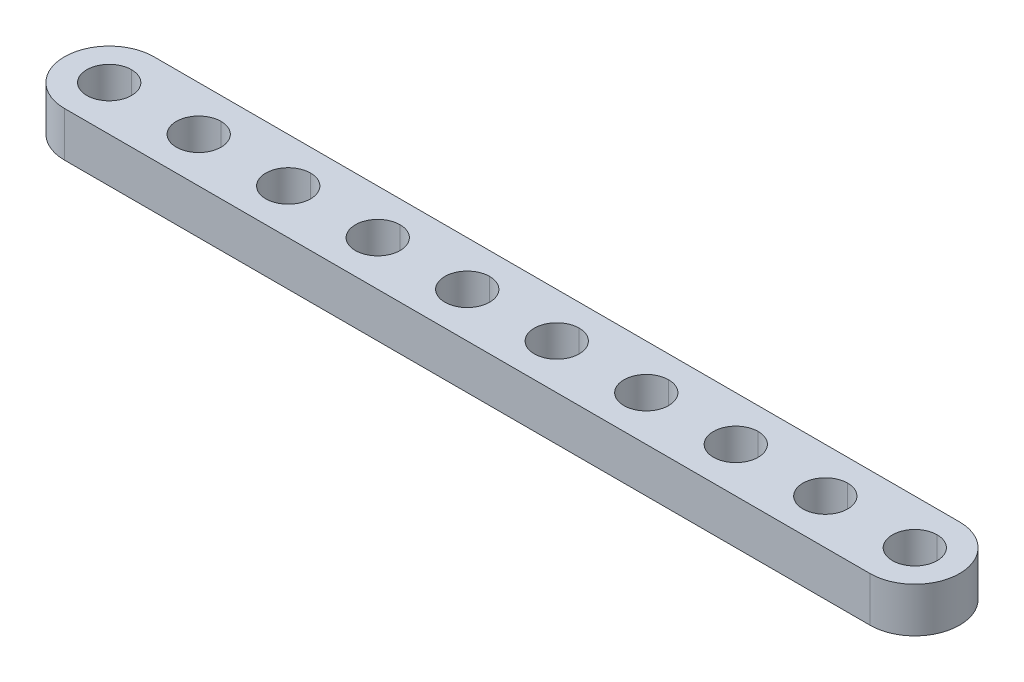
ISO-10303-21;
HEADER;
FILE_DESCRIPTION(('STEP AP214'),'2;1');
FILE_NAME('part.step','',(''),(''),'','','');
FILE_SCHEMA(('AUTOMOTIVE_DESIGN { 1 0 10303 214 1 1 1 1 }'));
ENDSEC;
DATA;
#1=APPLICATION_CONTEXT('core data for automotive mechanical design processes');
#2=APPLICATION_PROTOCOL_DEFINITION('international standard','automotive_design',2000,#1);
#3=PRODUCT_CONTEXT('',#1,'mechanical');
#4=PRODUCT('Part','Part','',(#3));
#5=PRODUCT_RELATED_PRODUCT_CATEGORY('part','',(#4));
#6=PRODUCT_DEFINITION_FORMATION('','',#4);
#7=PRODUCT_DEFINITION_CONTEXT('part definition',#1,'design');
#8=PRODUCT_DEFINITION('design','',#6,#7);
#9=PRODUCT_DEFINITION_SHAPE('','',#8);
#10=(LENGTH_UNIT() NAMED_UNIT(*) SI_UNIT(.MILLI.,.METRE.));
#11=(NAMED_UNIT(*) PLANE_ANGLE_UNIT() SI_UNIT($,.RADIAN.));
#12=(NAMED_UNIT(*) SI_UNIT($,.STERADIAN.) SOLID_ANGLE_UNIT());
#13=UNCERTAINTY_MEASURE_WITH_UNIT(LENGTH_MEASURE(1.E-05),#10,'distance_accuracy_value','');
#14=(GEOMETRIC_REPRESENTATION_CONTEXT(3) GLOBAL_UNCERTAINTY_ASSIGNED_CONTEXT((#13)) GLOBAL_UNIT_ASSIGNED_CONTEXT((#10,
#11,#12)) REPRESENTATION_CONTEXT('',''));
#15=CARTESIAN_POINT('',(0.,0.,0.));
#16=DIRECTION('',(0.,0.,1.));
#17=DIRECTION('',(1.,0.,0.));
#18=AXIS2_PLACEMENT_3D('',#15,#16,#17);
#19=CARTESIAN_POINT('',(36.,4.,0.));
#20=DIRECTION('',(0.,1.,0.));
#21=DIRECTION('',(0.,0.,1.));
#22=AXIS2_PLACEMENT_3D('',#19,#20,#21);
#23=CYLINDRICAL_SURFACE('',#22,2.);
#24=DIRECTION('',(0.,1.,0.));
#25=VECTOR('',#24,1.);
#26=CARTESIAN_POINT('',(36.,4.,-2.));
#27=LINE('',#26,#25);
#28=CARTESIAN_POINT('',(36.,0.,-2.));
#29=VERTEX_POINT('',#28);
#30=CARTESIAN_POINT('',(36.,4.,-2.));
#31=VERTEX_POINT('',#30);
#32=EDGE_CURVE('E283',#29,#31,#27,.T.);
#33=ORIENTED_EDGE('',*,*,#32,.F.);
#34=CARTESIAN_POINT('',(36.,0.,0.));
#35=DIRECTION('',(0.,1.,0.));
#36=DIRECTION('',(0.,0.,1.));
#37=AXIS2_PLACEMENT_3D('',#34,#35,#36);
#38=CIRCLE('',#37,2.);
#39=CARTESIAN_POINT('',(36.,0.,2.));
#40=VERTEX_POINT('',#39);
#41=EDGE_CURVE('E241',#40,#29,#38,.T.);
#42=ORIENTED_EDGE('',*,*,#41,.F.);
#43=DIRECTION('',(0.,1.,0.));
#44=VECTOR('',#43,1.);
#45=CARTESIAN_POINT('',(36.,4.,2.));
#46=LINE('',#45,#44);
#47=CARTESIAN_POINT('',(36.,4.,2.));
#48=VERTEX_POINT('',#47);
#49=EDGE_CURVE('E282',#40,#48,#46,.T.);
#50=ORIENTED_EDGE('',*,*,#49,.T.);
#51=CARTESIAN_POINT('',(36.,4.,0.));
#52=DIRECTION('',(0.,1.,0.));
#53=DIRECTION('',(0.,0.,1.));
#54=AXIS2_PLACEMENT_3D('',#51,#52,#53);
#55=CIRCLE('',#54,2.);
#56=EDGE_CURVE('E356',#48,#31,#55,.T.);
#57=ORIENTED_EDGE('',*,*,#56,.T.);
#58=EDGE_LOOP('',(#33,#42,#50,#57));
#59=FACE_BOUND('',#58,.T.);
#60=ADVANCED_FACE('F14',(#59),#23,.F.);
#61=CARTESIAN_POINT('',(28.,4.,0.));
#62=DIRECTION('',(0.,1.,0.));
#63=DIRECTION('',(0.,0.,1.));
#64=AXIS2_PLACEMENT_3D('',#61,#62,#63);
#65=CYLINDRICAL_SURFACE('',#64,2.);
#66=DIRECTION('',(0.,1.,0.));
#67=VECTOR('',#66,1.);
#68=CARTESIAN_POINT('',(28.,4.,-2.));
#69=LINE('',#68,#67);
#70=CARTESIAN_POINT('',(28.,0.,-2.));
#71=VERTEX_POINT('',#70);
#72=CARTESIAN_POINT('',(28.,4.,-2.));
#73=VERTEX_POINT('',#72);
#74=EDGE_CURVE('E322',#71,#73,#69,.T.);
#75=ORIENTED_EDGE('',*,*,#74,.F.);
#76=CARTESIAN_POINT('',(28.,0.,0.));
#77=DIRECTION('',(0.,1.,0.));
#78=DIRECTION('',(0.,0.,1.));
#79=AXIS2_PLACEMENT_3D('',#76,#77,#78);
#80=CIRCLE('',#79,2.);
#81=CARTESIAN_POINT('',(28.,0.,2.));
#82=VERTEX_POINT('',#81);
#83=EDGE_CURVE('E330',#82,#71,#80,.T.);
#84=ORIENTED_EDGE('',*,*,#83,.F.);
#85=DIRECTION('',(0.,1.,0.));
#86=VECTOR('',#85,1.);
#87=CARTESIAN_POINT('',(28.,4.,2.));
#88=LINE('',#87,#86);
#89=CARTESIAN_POINT('',(28.,4.,2.));
#90=VERTEX_POINT('',#89);
#91=EDGE_CURVE('E284',#82,#90,#88,.T.);
#92=ORIENTED_EDGE('',*,*,#91,.T.);
#93=CARTESIAN_POINT('',(28.,4.,0.));
#94=DIRECTION('',(0.,1.,0.));
#95=DIRECTION('',(0.,0.,1.));
#96=AXIS2_PLACEMENT_3D('',#93,#94,#95);
#97=CIRCLE('',#96,2.);
#98=EDGE_CURVE('E302',#90,#73,#97,.T.);
#99=ORIENTED_EDGE('',*,*,#98,.T.);
#100=EDGE_LOOP('',(#75,#84,#92,#99));
#101=FACE_BOUND('',#100,.T.);
#102=ADVANCED_FACE('F587',(#101),#65,.F.);
#103=CARTESIAN_POINT('',(20.,4.,0.));
#104=DIRECTION('',(0.,1.,0.));
#105=DIRECTION('',(0.,0.,1.));
#106=AXIS2_PLACEMENT_3D('',#103,#104,#105);
#107=CYLINDRICAL_SURFACE('',#106,2.);
#108=DIRECTION('',(0.,1.,0.));
#109=VECTOR('',#108,1.);
#110=CARTESIAN_POINT('',(20.,4.,-2.));
#111=LINE('',#110,#109);
#112=CARTESIAN_POINT('',(20.,0.,-2.));
#113=VERTEX_POINT('',#112);
#114=CARTESIAN_POINT('',(20.,4.,-2.));
#115=VERTEX_POINT('',#114);
#116=EDGE_CURVE('E323',#113,#115,#111,.T.);
#117=ORIENTED_EDGE('',*,*,#116,.F.);
#118=CARTESIAN_POINT('',(20.,0.,0.));
#119=DIRECTION('',(0.,1.,0.));
#120=DIRECTION('',(0.,0.,1.));
#121=AXIS2_PLACEMENT_3D('',#118,#119,#120);
#122=CIRCLE('',#121,2.);
#123=CARTESIAN_POINT('',(20.,0.,2.));
#124=VERTEX_POINT('',#123);
#125=EDGE_CURVE('E298',#124,#113,#122,.T.);
#126=ORIENTED_EDGE('',*,*,#125,.F.);
#127=DIRECTION('',(0.,1.,0.));
#128=VECTOR('',#127,1.);
#129=CARTESIAN_POINT('',(20.,4.,2.));
#130=LINE('',#129,#128);
#131=CARTESIAN_POINT('',(20.,4.,2.));
#132=VERTEX_POINT('',#131);
#133=EDGE_CURVE('E334',#124,#132,#130,.T.);
#134=ORIENTED_EDGE('',*,*,#133,.T.);
#135=CARTESIAN_POINT('',(20.,4.,0.));
#136=DIRECTION('',(0.,1.,0.));
#137=DIRECTION('',(0.,0.,1.));
#138=AXIS2_PLACEMENT_3D('',#135,#136,#137);
#139=CIRCLE('',#138,2.);
#140=EDGE_CURVE('E156',#132,#115,#139,.T.);
#141=ORIENTED_EDGE('',*,*,#140,.T.);
#142=EDGE_LOOP('',(#117,#126,#134,#141));
#143=FACE_BOUND('',#142,.T.);
#144=ADVANCED_FACE('F593',(#143),#107,.F.);
#145=CARTESIAN_POINT('',(12.,4.,0.));
#146=DIRECTION('',(0.,1.,0.));
#147=DIRECTION('',(0.,0.,1.));
#148=AXIS2_PLACEMENT_3D('',#145,#146,#147);
#149=CYLINDRICAL_SURFACE('',#148,2.);
#150=DIRECTION('',(0.,1.,0.));
#151=VECTOR('',#150,1.);
#152=CARTESIAN_POINT('',(12.,4.,-2.));
#153=LINE('',#152,#151);
#154=CARTESIAN_POINT('',(12.,0.,-2.));
#155=VERTEX_POINT('',#154);
#156=CARTESIAN_POINT('',(12.,4.,-2.));
#157=VERTEX_POINT('',#156);
#158=EDGE_CURVE('E376',#155,#157,#153,.T.);
#159=ORIENTED_EDGE('',*,*,#158,.F.);
#160=CARTESIAN_POINT('',(12.,0.,0.));
#161=DIRECTION('',(0.,1.,0.));
#162=DIRECTION('',(0.,0.,1.));
#163=AXIS2_PLACEMENT_3D('',#160,#161,#162);
#164=CIRCLE('',#163,2.);
#165=CARTESIAN_POINT('',(12.,0.,2.));
#166=VERTEX_POINT('',#165);
#167=EDGE_CURVE('E142',#166,#155,#164,.T.);
#168=ORIENTED_EDGE('',*,*,#167,.F.);
#169=DIRECTION('',(0.,1.,0.));
#170=VECTOR('',#169,1.);
#171=CARTESIAN_POINT('',(12.,4.,2.));
#172=LINE('',#171,#170);
#173=CARTESIAN_POINT('',(12.,4.,2.));
#174=VERTEX_POINT('',#173);
#175=EDGE_CURVE('E308',#166,#174,#172,.T.);
#176=ORIENTED_EDGE('',*,*,#175,.T.);
#177=CARTESIAN_POINT('',(12.,4.,0.));
#178=DIRECTION('',(0.,1.,0.));
#179=DIRECTION('',(0.,0.,1.));
#180=AXIS2_PLACEMENT_3D('',#177,#178,#179);
#181=CIRCLE('',#180,2.);
#182=EDGE_CURVE('E301',#174,#157,#181,.T.);
#183=ORIENTED_EDGE('',*,*,#182,.T.);
#184=EDGE_LOOP('',(#159,#168,#176,#183));
#185=FACE_BOUND('',#184,.T.);
#186=ADVANCED_FACE('F608',(#185),#149,.F.);
#187=CARTESIAN_POINT('',(4.,4.,0.));
#188=DIRECTION('',(0.,1.,0.));
#189=DIRECTION('',(0.,0.,1.));
#190=AXIS2_PLACEMENT_3D('',#187,#188,#189);
#191=CYLINDRICAL_SURFACE('',#190,2.);
#192=DIRECTION('',(0.,1.,0.));
#193=VECTOR('',#192,1.);
#194=CARTESIAN_POINT('',(4.,4.,-2.));
#195=LINE('',#194,#193);
#196=CARTESIAN_POINT('',(4.,0.,-2.));
#197=VERTEX_POINT('',#196);
#198=CARTESIAN_POINT('',(4.,4.,-2.));
#199=VERTEX_POINT('',#198);
#200=EDGE_CURVE('E393',#197,#199,#195,.T.);
#201=ORIENTED_EDGE('',*,*,#200,.F.);
#202=CARTESIAN_POINT('',(4.,0.,0.));
#203=DIRECTION('',(0.,1.,0.));
#204=DIRECTION('',(0.,0.,1.));
#205=AXIS2_PLACEMENT_3D('',#202,#203,#204);
#206=CIRCLE('',#205,2.);
#207=CARTESIAN_POINT('',(4.,0.,2.));
#208=VERTEX_POINT('',#207);
#209=EDGE_CURVE('E267',#208,#197,#206,.T.);
#210=ORIENTED_EDGE('',*,*,#209,.F.);
#211=DIRECTION('',(0.,1.,0.));
#212=VECTOR('',#211,1.);
#213=CARTESIAN_POINT('',(4.,4.,2.));
#214=LINE('',#213,#212);
#215=CARTESIAN_POINT('',(4.,4.,2.));
#216=VERTEX_POINT('',#215);
#217=EDGE_CURVE('E398',#208,#216,#214,.T.);
#218=ORIENTED_EDGE('',*,*,#217,.T.);
#219=CARTESIAN_POINT('',(4.,4.,0.));
#220=DIRECTION('',(0.,1.,0.));
#221=DIRECTION('',(0.,0.,1.));
#222=AXIS2_PLACEMENT_3D('',#219,#220,#221);
#223=CIRCLE('',#222,2.);
#224=EDGE_CURVE('E338',#216,#199,#223,.T.);
#225=ORIENTED_EDGE('',*,*,#224,.T.);
#226=EDGE_LOOP('',(#201,#210,#218,#225));
#227=FACE_BOUND('',#226,.T.);
#228=ADVANCED_FACE('F624',(#227),#191,.F.);
#229=CARTESIAN_POINT('',(-4.,4.,0.));
#230=DIRECTION('',(0.,1.,0.));
#231=DIRECTION('',(0.,0.,1.));
#232=AXIS2_PLACEMENT_3D('',#229,#230,#231);
#233=CYLINDRICAL_SURFACE('',#232,2.);
#234=DIRECTION('',(0.,1.,0.));
#235=VECTOR('',#234,1.);
#236=CARTESIAN_POINT('',(-4.,4.,-2.));
#237=LINE('',#236,#235);
#238=CARTESIAN_POINT('',(-4.,0.,-2.));
#239=VERTEX_POINT('',#238);
#240=CARTESIAN_POINT('',(-4.,4.,-2.));
#241=VERTEX_POINT('',#240);
#242=EDGE_CURVE('E345',#239,#241,#237,.T.);
#243=ORIENTED_EDGE('',*,*,#242,.F.);
#244=CARTESIAN_POINT('',(-4.,0.,0.));
#245=DIRECTION('',(0.,1.,0.));
#246=DIRECTION('',(0.,0.,1.));
#247=AXIS2_PLACEMENT_3D('',#244,#245,#246);
#248=CIRCLE('',#247,2.);
#249=CARTESIAN_POINT('',(-4.,0.,2.));
#250=VERTEX_POINT('',#249);
#251=EDGE_CURVE('E271',#250,#239,#248,.T.);
#252=ORIENTED_EDGE('',*,*,#251,.F.);
#253=DIRECTION('',(0.,1.,0.));
#254=VECTOR('',#253,1.);
#255=CARTESIAN_POINT('',(-4.,4.,2.));
#256=LINE('',#255,#254);
#257=CARTESIAN_POINT('',(-4.,4.,2.));
#258=VERTEX_POINT('',#257);
#259=EDGE_CURVE('E407',#250,#258,#256,.T.);
#260=ORIENTED_EDGE('',*,*,#259,.T.);
#261=CARTESIAN_POINT('',(-4.,4.,0.));
#262=DIRECTION('',(0.,1.,0.));
#263=DIRECTION('',(0.,0.,1.));
#264=AXIS2_PLACEMENT_3D('',#261,#262,#263);
#265=CIRCLE('',#264,2.);
#266=EDGE_CURVE('E341',#258,#241,#265,.T.);
#267=ORIENTED_EDGE('',*,*,#266,.T.);
#268=EDGE_LOOP('',(#243,#252,#260,#267));
#269=FACE_BOUND('',#268,.T.);
#270=ADVANCED_FACE('F506',(#269),#233,.F.);
#271=CARTESIAN_POINT('',(-12.,4.,0.));
#272=DIRECTION('',(0.,1.,0.));
#273=DIRECTION('',(0.,0.,1.));
#274=AXIS2_PLACEMENT_3D('',#271,#272,#273);
#275=CYLINDRICAL_SURFACE('',#274,2.);
#276=DIRECTION('',(0.,1.,0.));
#277=VECTOR('',#276,1.);
#278=CARTESIAN_POINT('',(-12.,4.,-2.));
#279=LINE('',#278,#277);
#280=CARTESIAN_POINT('',(-12.,0.,-2.));
#281=VERTEX_POINT('',#280);
#282=CARTESIAN_POINT('',(-12.,4.,-2.));
#283=VERTEX_POINT('',#282);
#284=EDGE_CURVE('E295',#281,#283,#279,.T.);
#285=ORIENTED_EDGE('',*,*,#284,.F.);
#286=CARTESIAN_POINT('',(-12.,0.,0.));
#287=DIRECTION('',(0.,1.,0.));
#288=DIRECTION('',(0.,0.,1.));
#289=AXIS2_PLACEMENT_3D('',#286,#287,#288);
#290=CIRCLE('',#289,2.);
#291=CARTESIAN_POINT('',(-12.,0.,2.));
#292=VERTEX_POINT('',#291);
#293=EDGE_CURVE('E337',#292,#281,#290,.T.);
#294=ORIENTED_EDGE('',*,*,#293,.F.);
#295=DIRECTION('',(0.,1.,0.));
#296=VECTOR('',#295,1.);
#297=CARTESIAN_POINT('',(-12.,4.,2.));
#298=LINE('',#297,#296);
#299=CARTESIAN_POINT('',(-12.,4.,2.));
#300=VERTEX_POINT('',#299);
#301=EDGE_CURVE('E294',#292,#300,#298,.T.);
#302=ORIENTED_EDGE('',*,*,#301,.T.);
#303=CARTESIAN_POINT('',(-12.,4.,0.));
#304=DIRECTION('',(0.,1.,0.));
#305=DIRECTION('',(0.,0.,1.));
#306=AXIS2_PLACEMENT_3D('',#303,#304,#305);
#307=CIRCLE('',#306,2.);
#308=EDGE_CURVE('E460',#300,#283,#307,.T.);
#309=ORIENTED_EDGE('',*,*,#308,.T.);
#310=EDGE_LOOP('',(#285,#294,#302,#309));
#311=FACE_BOUND('',#310,.T.);
#312=ADVANCED_FACE('F565',(#311),#275,.F.);
#313=CARTESIAN_POINT('',(-20.,4.,0.));
#314=DIRECTION('',(0.,1.,0.));
#315=DIRECTION('',(0.,0.,1.));
#316=AXIS2_PLACEMENT_3D('',#313,#314,#315);
#317=CYLINDRICAL_SURFACE('',#316,2.);
#318=DIRECTION('',(0.,1.,0.));
#319=VECTOR('',#318,1.);
#320=CARTESIAN_POINT('',(-20.,4.,-2.));
#321=LINE('',#320,#319);
#322=CARTESIAN_POINT('',(-20.,0.,-2.));
#323=VERTEX_POINT('',#322);
#324=CARTESIAN_POINT('',(-20.,4.,-2.));
#325=VERTEX_POINT('',#324);
#326=EDGE_CURVE('E307',#323,#325,#321,.T.);
#327=ORIENTED_EDGE('',*,*,#326,.F.);
#328=CARTESIAN_POINT('',(-20.,0.,0.));
#329=DIRECTION('',(0.,1.,0.));
#330=DIRECTION('',(0.,0.,1.));
#331=AXIS2_PLACEMENT_3D('',#328,#329,#330);
#332=CIRCLE('',#331,2.);
#333=CARTESIAN_POINT('',(-20.,0.,2.));
#334=VERTEX_POINT('',#333);
#335=EDGE_CURVE('E423',#334,#323,#332,.T.);
#336=ORIENTED_EDGE('',*,*,#335,.F.);
#337=DIRECTION('',(0.,1.,0.));
#338=VECTOR('',#337,1.);
#339=CARTESIAN_POINT('',(-20.,4.,2.));
#340=LINE('',#339,#338);
#341=CARTESIAN_POINT('',(-20.,4.,2.));
#342=VERTEX_POINT('',#341);
#343=EDGE_CURVE('E408',#334,#342,#340,.T.);
#344=ORIENTED_EDGE('',*,*,#343,.T.);
#345=CARTESIAN_POINT('',(-20.,4.,0.));
#346=DIRECTION('',(0.,1.,0.));
#347=DIRECTION('',(0.,0.,1.));
#348=AXIS2_PLACEMENT_3D('',#345,#346,#347);
#349=CIRCLE('',#348,2.);
#350=EDGE_CURVE('E462',#342,#325,#349,.T.);
#351=ORIENTED_EDGE('',*,*,#350,.T.);
#352=EDGE_LOOP('',(#327,#336,#344,#351));
#353=FACE_BOUND('',#352,.T.);
#354=ADVANCED_FACE('F621',(#353),#317,.F.);
#355=CARTESIAN_POINT('',(-28.,4.,0.));
#356=DIRECTION('',(0.,1.,0.));
#357=DIRECTION('',(0.,0.,1.));
#358=AXIS2_PLACEMENT_3D('',#355,#356,#357);
#359=CYLINDRICAL_SURFACE('',#358,2.);
#360=DIRECTION('',(0.,1.,0.));
#361=VECTOR('',#360,1.);
#362=CARTESIAN_POINT('',(-28.,4.,-2.));
#363=LINE('',#362,#361);
#364=CARTESIAN_POINT('',(-28.,0.,-2.));
#365=VERTEX_POINT('',#364);
#366=CARTESIAN_POINT('',(-28.,4.,-2.));
#367=VERTEX_POINT('',#366);
#368=EDGE_CURVE('E363',#365,#367,#363,.T.);
#369=ORIENTED_EDGE('',*,*,#368,.F.);
#370=CARTESIAN_POINT('',(-28.,0.,0.));
#371=DIRECTION('',(0.,1.,0.));
#372=DIRECTION('',(0.,0.,1.));
#373=AXIS2_PLACEMENT_3D('',#370,#371,#372);
#374=CIRCLE('',#373,2.);
#375=CARTESIAN_POINT('',(-28.,0.,2.));
#376=VERTEX_POINT('',#375);
#377=EDGE_CURVE('E24',#376,#365,#374,.T.);
#378=ORIENTED_EDGE('',*,*,#377,.F.);
#379=DIRECTION('',(0.,1.,0.));
#380=VECTOR('',#379,1.);
#381=CARTESIAN_POINT('',(-28.,4.,2.));
#382=LINE('',#381,#380);
#383=CARTESIAN_POINT('',(-28.,4.,2.));
#384=VERTEX_POINT('',#383);
#385=EDGE_CURVE('E399',#376,#384,#382,.T.);
#386=ORIENTED_EDGE('',*,*,#385,.T.);
#387=CARTESIAN_POINT('',(-28.,4.,0.));
#388=DIRECTION('',(0.,1.,0.));
#389=DIRECTION('',(0.,0.,1.));
#390=AXIS2_PLACEMENT_3D('',#387,#388,#389);
#391=CIRCLE('',#390,2.);
#392=EDGE_CURVE('E242',#384,#367,#391,.T.);
#393=ORIENTED_EDGE('',*,*,#392,.T.);
#394=EDGE_LOOP('',(#369,#378,#386,#393));
#395=FACE_BOUND('',#394,.T.);
#396=ADVANCED_FACE('F618',(#395),#359,.F.);
#397=CARTESIAN_POINT('',(-36.,4.,0.));
#398=DIRECTION('',(0.,1.,0.));
#399=DIRECTION('',(0.,0.,1.));
#400=AXIS2_PLACEMENT_3D('',#397,#398,#399);
#401=CYLINDRICAL_SURFACE('',#400,2.);
#402=DIRECTION('',(0.,1.,0.));
#403=VECTOR('',#402,1.);
#404=CARTESIAN_POINT('',(-36.,4.,-2.));
#405=LINE('',#404,#403);
#406=CARTESIAN_POINT('',(-36.,0.,-2.));
#407=VERTEX_POINT('',#406);
#408=CARTESIAN_POINT('',(-36.,4.,-2.));
#409=VERTEX_POINT('',#408);
#410=EDGE_CURVE('E254',#407,#409,#405,.T.);
#411=ORIENTED_EDGE('',*,*,#410,.F.);
#412=CARTESIAN_POINT('',(-36.,0.,0.));
#413=DIRECTION('',(0.,1.,0.));
#414=DIRECTION('',(0.,0.,1.));
#415=AXIS2_PLACEMENT_3D('',#412,#413,#414);
#416=CIRCLE('',#415,2.);
#417=CARTESIAN_POINT('',(-36.,0.,2.));
#418=VERTEX_POINT('',#417);
#419=EDGE_CURVE('E9',#418,#407,#416,.T.);
#420=ORIENTED_EDGE('',*,*,#419,.F.);
#421=DIRECTION('',(0.,1.,0.));
#422=VECTOR('',#421,1.);
#423=CARTESIAN_POINT('',(-36.,4.,2.));
#424=LINE('',#423,#422);
#425=CARTESIAN_POINT('',(-36.,4.,2.));
#426=VERTEX_POINT('',#425);
#427=EDGE_CURVE('E245',#418,#426,#424,.T.);
#428=ORIENTED_EDGE('',*,*,#427,.T.);
#429=CARTESIAN_POINT('',(-36.,4.,0.));
#430=DIRECTION('',(0.,1.,0.));
#431=DIRECTION('',(0.,0.,1.));
#432=AXIS2_PLACEMENT_3D('',#429,#430,#431);
#433=CIRCLE('',#432,2.);
#434=EDGE_CURVE('E232',#426,#409,#433,.T.);
#435=ORIENTED_EDGE('',*,*,#434,.T.);
#436=EDGE_LOOP('',(#411,#420,#428,#435));
#437=FACE_BOUND('',#436,.T.);
#438=ADVANCED_FACE('F246',(#437),#401,.F.);
#439=CARTESIAN_POINT('',(-36.,0.,0.));
#440=DIRECTION('',(0.,1.,0.));
#441=DIRECTION('',(1.,0.,0.));
#442=AXIS2_PLACEMENT_3D('',#439,#440,#441);
#443=PLANE('',#442);
#444=ORIENTED_EDGE('',*,*,#419,.T.);
#445=CARTESIAN_POINT('',(-36.,0.,0.));
#446=DIRECTION('',(0.,1.,0.));
#447=DIRECTION('',(0.,0.,1.));
#448=AXIS2_PLACEMENT_3D('',#445,#446,#447);
#449=CIRCLE('',#448,2.);
#450=EDGE_CURVE('E261',#407,#418,#449,.T.);
#451=ORIENTED_EDGE('',*,*,#450,.T.);
#452=EDGE_LOOP('',(#444,#451));
#453=FACE_BOUND('',#452,.T.);
#454=ORIENTED_EDGE('',*,*,#377,.T.);
#455=CARTESIAN_POINT('',(-28.,0.,0.));
#456=DIRECTION('',(0.,1.,0.));
#457=DIRECTION('',(0.,0.,1.));
#458=AXIS2_PLACEMENT_3D('',#455,#456,#457);
#459=CIRCLE('',#458,2.);
#460=EDGE_CURVE('E368',#365,#376,#459,.T.);
#461=ORIENTED_EDGE('',*,*,#460,.T.);
#462=EDGE_LOOP('',(#454,#461));
#463=FACE_BOUND('',#462,.T.);
#464=ORIENTED_EDGE('',*,*,#335,.T.);
#465=CARTESIAN_POINT('',(-20.,0.,0.));
#466=DIRECTION('',(0.,1.,0.));
#467=DIRECTION('',(0.,0.,1.));
#468=AXIS2_PLACEMENT_3D('',#465,#466,#467);
#469=CIRCLE('',#468,2.);
#470=EDGE_CURVE('E303',#323,#334,#469,.T.);
#471=ORIENTED_EDGE('',*,*,#470,.T.);
#472=EDGE_LOOP('',(#464,#471));
#473=FACE_BOUND('',#472,.T.);
#474=ORIENTED_EDGE('',*,*,#293,.T.);
#475=CARTESIAN_POINT('',(-12.,0.,0.));
#476=DIRECTION('',(0.,1.,0.));
#477=DIRECTION('',(0.,0.,1.));
#478=AXIS2_PLACEMENT_3D('',#475,#476,#477);
#479=CIRCLE('',#478,2.);
#480=EDGE_CURVE('E403',#281,#292,#479,.T.);
#481=ORIENTED_EDGE('',*,*,#480,.T.);
#482=EDGE_LOOP('',(#474,#481));
#483=FACE_BOUND('',#482,.T.);
#484=ORIENTED_EDGE('',*,*,#251,.T.);
#485=CARTESIAN_POINT('',(-4.,0.,0.));
#486=DIRECTION('',(0.,1.,0.));
#487=DIRECTION('',(0.,0.,1.));
#488=AXIS2_PLACEMENT_3D('',#485,#486,#487);
#489=CIRCLE('',#488,2.);
#490=EDGE_CURVE('E264',#239,#250,#489,.T.);
#491=ORIENTED_EDGE('',*,*,#490,.T.);
#492=EDGE_LOOP('',(#484,#491));
#493=FACE_BOUND('',#492,.T.);
#494=ORIENTED_EDGE('',*,*,#209,.T.);
#495=CARTESIAN_POINT('',(4.,0.,0.));
#496=DIRECTION('',(0.,1.,0.));
#497=DIRECTION('',(0.,0.,1.));
#498=AXIS2_PLACEMENT_3D('',#495,#496,#497);
#499=CIRCLE('',#498,2.);
#500=EDGE_CURVE('E312',#197,#208,#499,.T.);
#501=ORIENTED_EDGE('',*,*,#500,.T.);
#502=EDGE_LOOP('',(#494,#501));
#503=FACE_BOUND('',#502,.T.);
#504=ORIENTED_EDGE('',*,*,#167,.T.);
#505=CARTESIAN_POINT('',(12.,0.,0.));
#506=DIRECTION('',(0.,1.,0.));
#507=DIRECTION('',(0.,0.,1.));
#508=AXIS2_PLACEMENT_3D('',#505,#506,#507);
#509=CIRCLE('',#508,2.);
#510=EDGE_CURVE('E371',#155,#166,#509,.T.);
#511=ORIENTED_EDGE('',*,*,#510,.T.);
#512=EDGE_LOOP('',(#504,#511));
#513=FACE_BOUND('',#512,.T.);
#514=ORIENTED_EDGE('',*,*,#125,.T.);
#515=CARTESIAN_POINT('',(20.,0.,0.));
#516=DIRECTION('',(0.,1.,0.));
#517=DIRECTION('',(0.,0.,1.));
#518=AXIS2_PLACEMENT_3D('',#515,#516,#517);
#519=CIRCLE('',#518,2.);
#520=EDGE_CURVE('E288',#113,#124,#519,.T.);
#521=ORIENTED_EDGE('',*,*,#520,.T.);
#522=EDGE_LOOP('',(#514,#521));
#523=FACE_BOUND('',#522,.T.);
#524=ORIENTED_EDGE('',*,*,#83,.T.);
#525=CARTESIAN_POINT('',(28.,0.,0.));
#526=DIRECTION('',(0.,1.,0.));
#527=DIRECTION('',(0.,0.,1.));
#528=AXIS2_PLACEMENT_3D('',#525,#526,#527);
#529=CIRCLE('',#528,2.);
#530=EDGE_CURVE('E318',#71,#82,#529,.T.);
#531=ORIENTED_EDGE('',*,*,#530,.T.);
#532=EDGE_LOOP('',(#524,#531));
#533=FACE_BOUND('',#532,.T.);
#534=ORIENTED_EDGE('',*,*,#41,.T.);
#535=CARTESIAN_POINT('',(36.,0.,0.));
#536=DIRECTION('',(0.,1.,0.));
#537=DIRECTION('',(0.,0.,1.));
#538=AXIS2_PLACEMENT_3D('',#535,#536,#537);
#539=CIRCLE('',#538,2.);
#540=EDGE_CURVE('E359',#29,#40,#539,.T.);
#541=ORIENTED_EDGE('',*,*,#540,.T.);
#542=EDGE_LOOP('',(#534,#541));
#543=FACE_BOUND('',#542,.T.);
#544=CARTESIAN_POINT('',(-36.,0.,0.));
#545=DIRECTION('',(0.,1.,0.));
#546=DIRECTION('',(0.,0.,1.));
#547=AXIS2_PLACEMENT_3D('',#544,#545,#546);
#548=CIRCLE('',#547,4.);
#549=CARTESIAN_POINT('',(-36.,0.,-4.));
#550=VERTEX_POINT('',#549);
#551=CARTESIAN_POINT('',(-36.,0.,4.));
#552=VERTEX_POINT('',#551);
#553=EDGE_CURVE('E251',#550,#552,#548,.T.);
#554=ORIENTED_EDGE('',*,*,#553,.F.);
#555=DIRECTION('',(-1.,0.,0.));
#556=VECTOR('',#555,1.);
#557=CARTESIAN_POINT('',(-36.,0.,-4.));
#558=LINE('',#557,#556);
#559=CARTESIAN_POINT('',(36.,0.,-4.));
#560=VERTEX_POINT('',#559);
#561=EDGE_CURVE('E350',#560,#550,#558,.T.);
#562=ORIENTED_EDGE('',*,*,#561,.F.);
#563=CARTESIAN_POINT('',(36.,0.,0.));
#564=DIRECTION('',(0.,1.,0.));
#565=DIRECTION('',(0.,0.,1.));
#566=AXIS2_PLACEMENT_3D('',#563,#564,#565);
#567=CIRCLE('',#566,4.);
#568=CARTESIAN_POINT('',(36.,0.,4.));
#569=VERTEX_POINT('',#568);
#570=EDGE_CURVE('E375',#569,#560,#567,.T.);
#571=ORIENTED_EDGE('',*,*,#570,.F.);
#572=DIRECTION('',(1.,0.,0.));
#573=VECTOR('',#572,1.);
#574=CARTESIAN_POINT('',(-36.,0.,4.));
#575=LINE('',#574,#573);
#576=EDGE_CURVE('E272',#552,#569,#575,.T.);
#577=ORIENTED_EDGE('',*,*,#576,.F.);
#578=EDGE_LOOP('',(#554,#562,#571,#577));
#579=FACE_BOUND('',#578,.T.);
#580=ADVANCED_FACE('F415',(#453,#463,#473,#483,#493,#503,#513,#523,#533,#543,#579),#443,.F.);
#581=CARTESIAN_POINT('',(-36.,4.,0.));
#582=DIRECTION('',(0.,1.,0.));
#583=DIRECTION('',(1.,0.,0.));
#584=AXIS2_PLACEMENT_3D('',#581,#582,#583);
#585=PLANE('',#584);
#586=ORIENTED_EDGE('',*,*,#434,.F.);
#587=CARTESIAN_POINT('',(-36.,4.,0.));
#588=DIRECTION('',(0.,1.,0.));
#589=DIRECTION('',(0.,0.,1.));
#590=AXIS2_PLACEMENT_3D('',#587,#588,#589);
#591=CIRCLE('',#590,2.);
#592=EDGE_CURVE('E236',#409,#426,#591,.T.);
#593=ORIENTED_EDGE('',*,*,#592,.F.);
#594=EDGE_LOOP('',(#586,#593));
#595=FACE_BOUND('',#594,.T.);
#596=ORIENTED_EDGE('',*,*,#392,.F.);
#597=CARTESIAN_POINT('',(-28.,4.,0.));
#598=DIRECTION('',(0.,1.,0.));
#599=DIRECTION('',(0.,0.,1.));
#600=AXIS2_PLACEMENT_3D('',#597,#598,#599);
#601=CIRCLE('',#600,2.);
#602=EDGE_CURVE('E367',#367,#384,#601,.T.);
#603=ORIENTED_EDGE('',*,*,#602,.F.);
#604=EDGE_LOOP('',(#596,#603));
#605=FACE_BOUND('',#604,.T.);
#606=ORIENTED_EDGE('',*,*,#350,.F.);
#607=CARTESIAN_POINT('',(-20.,4.,0.));
#608=DIRECTION('',(0.,1.,0.));
#609=DIRECTION('',(0.,0.,1.));
#610=AXIS2_PLACEMENT_3D('',#607,#608,#609);
#611=CIRCLE('',#610,2.);
#612=EDGE_CURVE('E317',#325,#342,#611,.T.);
#613=ORIENTED_EDGE('',*,*,#612,.F.);
#614=EDGE_LOOP('',(#606,#613));
#615=FACE_BOUND('',#614,.T.);
#616=ORIENTED_EDGE('',*,*,#308,.F.);
#617=CARTESIAN_POINT('',(-12.,4.,0.));
#618=DIRECTION('',(0.,1.,0.));
#619=DIRECTION('',(0.,0.,1.));
#620=AXIS2_PLACEMENT_3D('',#617,#618,#619);
#621=CIRCLE('',#620,2.);
#622=EDGE_CURVE('E290',#283,#300,#621,.T.);
#623=ORIENTED_EDGE('',*,*,#622,.F.);
#624=EDGE_LOOP('',(#616,#623));
#625=FACE_BOUND('',#624,.T.);
#626=ORIENTED_EDGE('',*,*,#266,.F.);
#627=CARTESIAN_POINT('',(-4.,4.,0.));
#628=DIRECTION('',(0.,1.,0.));
#629=DIRECTION('',(0.,0.,1.));
#630=AXIS2_PLACEMENT_3D('',#627,#628,#629);
#631=CIRCLE('',#630,2.);
#632=EDGE_CURVE('E349',#241,#258,#631,.T.);
#633=ORIENTED_EDGE('',*,*,#632,.F.);
#634=EDGE_LOOP('',(#626,#633));
#635=FACE_BOUND('',#634,.T.);
#636=ORIENTED_EDGE('',*,*,#224,.F.);
#637=CARTESIAN_POINT('',(4.,4.,0.));
#638=DIRECTION('',(0.,1.,0.));
#639=DIRECTION('',(0.,0.,1.));
#640=AXIS2_PLACEMENT_3D('',#637,#638,#639);
#641=CIRCLE('',#640,2.);
#642=EDGE_CURVE('E394',#199,#216,#641,.T.);
#643=ORIENTED_EDGE('',*,*,#642,.F.);
#644=EDGE_LOOP('',(#636,#643));
#645=FACE_BOUND('',#644,.T.);
#646=ORIENTED_EDGE('',*,*,#182,.F.);
#647=CARTESIAN_POINT('',(12.,4.,0.));
#648=DIRECTION('',(0.,1.,0.));
#649=DIRECTION('',(0.,0.,1.));
#650=AXIS2_PLACEMENT_3D('',#647,#648,#649);
#651=CIRCLE('',#650,2.);
#652=EDGE_CURVE('E313',#157,#174,#651,.T.);
#653=ORIENTED_EDGE('',*,*,#652,.F.);
#654=EDGE_LOOP('',(#646,#653));
#655=FACE_BOUND('',#654,.T.);
#656=ORIENTED_EDGE('',*,*,#140,.F.);
#657=CARTESIAN_POINT('',(20.,4.,0.));
#658=DIRECTION('',(0.,1.,0.));
#659=DIRECTION('',(0.,0.,1.));
#660=AXIS2_PLACEMENT_3D('',#657,#658,#659);
#661=CIRCLE('',#660,2.);
#662=EDGE_CURVE('E327',#115,#132,#661,.T.);
#663=ORIENTED_EDGE('',*,*,#662,.F.);
#664=EDGE_LOOP('',(#656,#663));
#665=FACE_BOUND('',#664,.T.);
#666=ORIENTED_EDGE('',*,*,#98,.F.);
#667=CARTESIAN_POINT('',(28.,4.,0.));
#668=DIRECTION('',(0.,1.,0.));
#669=DIRECTION('',(0.,0.,1.));
#670=AXIS2_PLACEMENT_3D('',#667,#668,#669);
#671=CIRCLE('',#670,2.);
#672=EDGE_CURVE('E289',#73,#90,#671,.T.);
#673=ORIENTED_EDGE('',*,*,#672,.F.);
#674=EDGE_LOOP('',(#666,#673));
#675=FACE_BOUND('',#674,.T.);
#676=ORIENTED_EDGE('',*,*,#56,.F.);
#677=CARTESIAN_POINT('',(36.,4.,0.));
#678=DIRECTION('',(0.,1.,0.));
#679=DIRECTION('',(0.,0.,1.));
#680=AXIS2_PLACEMENT_3D('',#677,#678,#679);
#681=CIRCLE('',#680,2.);
#682=EDGE_CURVE('E278',#31,#48,#681,.T.);
#683=ORIENTED_EDGE('',*,*,#682,.F.);
#684=EDGE_LOOP('',(#676,#683));
#685=FACE_BOUND('',#684,.T.);
#686=CARTESIAN_POINT('',(-36.,4.,0.));
#687=DIRECTION('',(0.,1.,0.));
#688=DIRECTION('',(0.,0.,1.));
#689=AXIS2_PLACEMENT_3D('',#686,#687,#688);
#690=CIRCLE('',#689,4.);
#691=CARTESIAN_POINT('',(-36.,4.,-4.));
#692=VERTEX_POINT('',#691);
#693=CARTESIAN_POINT('',(-36.,4.,4.));
#694=VERTEX_POINT('',#693);
#695=EDGE_CURVE('E455',#692,#694,#690,.T.);
#696=ORIENTED_EDGE('',*,*,#695,.T.);
#697=DIRECTION('',(1.,0.,0.));
#698=VECTOR('',#697,1.);
#699=CARTESIAN_POINT('',(-36.,4.,4.));
#700=LINE('',#699,#698);
#701=CARTESIAN_POINT('',(36.,4.,4.));
#702=VERTEX_POINT('',#701);
#703=EDGE_CURVE('E383',#694,#702,#700,.T.);
#704=ORIENTED_EDGE('',*,*,#703,.T.);
#705=CARTESIAN_POINT('',(36.,4.,0.));
#706=DIRECTION('',(0.,1.,0.));
#707=DIRECTION('',(0.,0.,1.));
#708=AXIS2_PLACEMENT_3D('',#705,#706,#707);
#709=CIRCLE('',#708,4.);
#710=CARTESIAN_POINT('',(36.,4.,-4.));
#711=VERTEX_POINT('',#710);
#712=EDGE_CURVE('E353',#702,#711,#709,.T.);
#713=ORIENTED_EDGE('',*,*,#712,.T.);
#714=DIRECTION('',(-1.,0.,0.));
#715=VECTOR('',#714,1.);
#716=CARTESIAN_POINT('',(-36.,4.,-4.));
#717=LINE('',#716,#715);
#718=EDGE_CURVE('E38',#711,#692,#717,.T.);
#719=ORIENTED_EDGE('',*,*,#718,.T.);
#720=EDGE_LOOP('',(#696,#704,#713,#719));
#721=FACE_BOUND('',#720,.T.);
#722=ADVANCED_FACE('F16',(#595,#605,#615,#625,#635,#645,#655,#665,#675,#685,#721),#585,.T.);
#723=CARTESIAN_POINT('',(-36.,4.,-4.));
#724=DIRECTION('',(0.,0.,1.));
#725=DIRECTION('',(1.,0.,0.));
#726=AXIS2_PLACEMENT_3D('',#723,#724,#725);
#727=PLANE('',#726);
#728=ORIENTED_EDGE('',*,*,#561,.T.);
#729=DIRECTION('',(0.,-1.,0.));
#730=VECTOR('',#729,1.);
#731=CARTESIAN_POINT('',(-36.,4.,-4.));
#732=LINE('',#731,#730);
#733=EDGE_CURVE('E277',#692,#550,#732,.T.);
#734=ORIENTED_EDGE('',*,*,#733,.F.);
#735=ORIENTED_EDGE('',*,*,#718,.F.);
#736=DIRECTION('',(0.,-1.,0.));
#737=VECTOR('',#736,1.);
#738=CARTESIAN_POINT('',(36.,4.,-4.));
#739=LINE('',#738,#737);
#740=EDGE_CURVE('E372',#711,#560,#739,.T.);
#741=ORIENTED_EDGE('',*,*,#740,.T.);
#742=EDGE_LOOP('',(#728,#734,#735,#741));
#743=FACE_BOUND('',#742,.T.);
#744=ADVANCED_FACE('F512',(#743),#727,.F.);
#745=CARTESIAN_POINT('',(36.,4.,0.));
#746=DIRECTION('',(0.,-1.,0.));
#747=DIRECTION('',(0.,0.,-1.));
#748=AXIS2_PLACEMENT_3D('',#745,#746,#747);
#749=CYLINDRICAL_SURFACE('',#748,4.);
#750=ORIENTED_EDGE('',*,*,#570,.T.);
#751=ORIENTED_EDGE('',*,*,#740,.F.);
#752=ORIENTED_EDGE('',*,*,#712,.F.);
#753=DIRECTION('',(0.,-1.,0.));
#754=VECTOR('',#753,1.);
#755=CARTESIAN_POINT('',(36.,4.,4.));
#756=LINE('',#755,#754);
#757=EDGE_CURVE('E276',#702,#569,#756,.T.);
#758=ORIENTED_EDGE('',*,*,#757,.T.);
#759=EDGE_LOOP('',(#750,#751,#752,#758));
#760=FACE_BOUND('',#759,.T.);
#761=ADVANCED_FACE('F527',(#760),#749,.T.);
#762=CARTESIAN_POINT('',(-36.,4.,4.));
#763=DIRECTION('',(0.,0.,-1.));
#764=DIRECTION('',(0.,-1.,0.));
#765=AXIS2_PLACEMENT_3D('',#762,#763,#764);
#766=PLANE('',#765);
#767=ORIENTED_EDGE('',*,*,#576,.T.);
#768=ORIENTED_EDGE('',*,*,#757,.F.);
#769=ORIENTED_EDGE('',*,*,#703,.F.);
#770=DIRECTION('',(0.,-1.,0.));
#771=VECTOR('',#770,1.);
#772=CARTESIAN_POINT('',(-36.,4.,4.));
#773=LINE('',#772,#771);
#774=EDGE_CURVE('E448',#694,#552,#773,.T.);
#775=ORIENTED_EDGE('',*,*,#774,.T.);
#776=EDGE_LOOP('',(#767,#768,#769,#775));
#777=FACE_BOUND('',#776,.T.);
#778=ADVANCED_FACE('F525',(#777),#766,.F.);
#779=CARTESIAN_POINT('',(-36.,4.,0.));
#780=DIRECTION('',(0.,-1.,0.));
#781=DIRECTION('',(0.,0.,-1.));
#782=AXIS2_PLACEMENT_3D('',#779,#780,#781);
#783=CYLINDRICAL_SURFACE('',#782,4.);
#784=ORIENTED_EDGE('',*,*,#553,.T.);
#785=ORIENTED_EDGE('',*,*,#774,.F.);
#786=ORIENTED_EDGE('',*,*,#695,.F.);
#787=ORIENTED_EDGE('',*,*,#733,.T.);
#788=EDGE_LOOP('',(#784,#785,#786,#787));
#789=FACE_BOUND('',#788,.T.);
#790=ADVANCED_FACE('F523',(#789),#783,.T.);
#791=CARTESIAN_POINT('',(-36.,4.,0.));
#792=DIRECTION('',(0.,1.,0.));
#793=DIRECTION('',(0.,0.,1.));
#794=AXIS2_PLACEMENT_3D('',#791,#792,#793);
#795=CYLINDRICAL_SURFACE('',#794,2.);
#796=ORIENTED_EDGE('',*,*,#450,.F.);
#797=ORIENTED_EDGE('',*,*,#410,.T.);
#798=ORIENTED_EDGE('',*,*,#592,.T.);
#799=ORIENTED_EDGE('',*,*,#427,.F.);
#800=EDGE_LOOP('',(#796,#797,#798,#799));
#801=FACE_BOUND('',#800,.T.);
#802=ADVANCED_FACE('F253',(#801),#795,.F.);
#803=CARTESIAN_POINT('',(-28.,4.,0.));
#804=DIRECTION('',(0.,1.,0.));
#805=DIRECTION('',(0.,0.,1.));
#806=AXIS2_PLACEMENT_3D('',#803,#804,#805);
#807=CYLINDRICAL_SURFACE('',#806,2.);
#808=ORIENTED_EDGE('',*,*,#460,.F.);
#809=ORIENTED_EDGE('',*,*,#368,.T.);
#810=ORIENTED_EDGE('',*,*,#602,.T.);
#811=ORIENTED_EDGE('',*,*,#385,.F.);
#812=EDGE_LOOP('',(#808,#809,#810,#811));
#813=FACE_BOUND('',#812,.T.);
#814=ADVANCED_FACE('F581',(#813),#807,.F.);
#815=CARTESIAN_POINT('',(-20.,4.,0.));
#816=DIRECTION('',(0.,1.,0.));
#817=DIRECTION('',(0.,0.,1.));
#818=AXIS2_PLACEMENT_3D('',#815,#816,#817);
#819=CYLINDRICAL_SURFACE('',#818,2.);
#820=ORIENTED_EDGE('',*,*,#470,.F.);
#821=ORIENTED_EDGE('',*,*,#326,.T.);
#822=ORIENTED_EDGE('',*,*,#612,.T.);
#823=ORIENTED_EDGE('',*,*,#343,.F.);
#824=EDGE_LOOP('',(#820,#821,#822,#823));
#825=FACE_BOUND('',#824,.T.);
#826=ADVANCED_FACE('F572',(#825),#819,.F.);
#827=CARTESIAN_POINT('',(-12.,4.,0.));
#828=DIRECTION('',(0.,1.,0.));
#829=DIRECTION('',(0.,0.,1.));
#830=AXIS2_PLACEMENT_3D('',#827,#828,#829);
#831=CYLINDRICAL_SURFACE('',#830,2.);
#832=ORIENTED_EDGE('',*,*,#480,.F.);
#833=ORIENTED_EDGE('',*,*,#284,.T.);
#834=ORIENTED_EDGE('',*,*,#622,.T.);
#835=ORIENTED_EDGE('',*,*,#301,.F.);
#836=EDGE_LOOP('',(#832,#833,#834,#835));
#837=FACE_BOUND('',#836,.T.);
#838=ADVANCED_FACE('F569',(#837),#831,.F.);
#839=CARTESIAN_POINT('',(-4.,4.,0.));
#840=DIRECTION('',(0.,1.,0.));
#841=DIRECTION('',(0.,0.,1.));
#842=AXIS2_PLACEMENT_3D('',#839,#840,#841);
#843=CYLINDRICAL_SURFACE('',#842,2.);
#844=ORIENTED_EDGE('',*,*,#490,.F.);
#845=ORIENTED_EDGE('',*,*,#242,.T.);
#846=ORIENTED_EDGE('',*,*,#632,.T.);
#847=ORIENTED_EDGE('',*,*,#259,.F.);
#848=EDGE_LOOP('',(#844,#845,#846,#847));
#849=FACE_BOUND('',#848,.T.);
#850=ADVANCED_FACE('F503',(#849),#843,.F.);
#851=CARTESIAN_POINT('',(4.,4.,0.));
#852=DIRECTION('',(0.,1.,0.));
#853=DIRECTION('',(0.,0.,1.));
#854=AXIS2_PLACEMENT_3D('',#851,#852,#853);
#855=CYLINDRICAL_SURFACE('',#854,2.);
#856=ORIENTED_EDGE('',*,*,#500,.F.);
#857=ORIENTED_EDGE('',*,*,#200,.T.);
#858=ORIENTED_EDGE('',*,*,#642,.T.);
#859=ORIENTED_EDGE('',*,*,#217,.F.);
#860=EDGE_LOOP('',(#856,#857,#858,#859));
#861=FACE_BOUND('',#860,.T.);
#862=ADVANCED_FACE('F579',(#861),#855,.F.);
#863=CARTESIAN_POINT('',(12.,4.,0.));
#864=DIRECTION('',(0.,1.,0.));
#865=DIRECTION('',(0.,0.,1.));
#866=AXIS2_PLACEMENT_3D('',#863,#864,#865);
#867=CYLINDRICAL_SURFACE('',#866,2.);
#868=ORIENTED_EDGE('',*,*,#510,.F.);
#869=ORIENTED_EDGE('',*,*,#158,.T.);
#870=ORIENTED_EDGE('',*,*,#652,.T.);
#871=ORIENTED_EDGE('',*,*,#175,.F.);
#872=EDGE_LOOP('',(#868,#869,#870,#871));
#873=FACE_BOUND('',#872,.T.);
#874=ADVANCED_FACE('F612',(#873),#867,.F.);
#875=CARTESIAN_POINT('',(20.,4.,0.));
#876=DIRECTION('',(0.,1.,0.));
#877=DIRECTION('',(0.,0.,1.));
#878=AXIS2_PLACEMENT_3D('',#875,#876,#877);
#879=CYLINDRICAL_SURFACE('',#878,2.);
#880=ORIENTED_EDGE('',*,*,#520,.F.);
#881=ORIENTED_EDGE('',*,*,#116,.T.);
#882=ORIENTED_EDGE('',*,*,#662,.T.);
#883=ORIENTED_EDGE('',*,*,#133,.F.);
#884=EDGE_LOOP('',(#880,#881,#882,#883));
#885=FACE_BOUND('',#884,.T.);
#886=ADVANCED_FACE('F602',(#885),#879,.F.);
#887=CARTESIAN_POINT('',(28.,4.,0.));
#888=DIRECTION('',(0.,1.,0.));
#889=DIRECTION('',(0.,0.,1.));
#890=AXIS2_PLACEMENT_3D('',#887,#888,#889);
#891=CYLINDRICAL_SURFACE('',#890,2.);
#892=ORIENTED_EDGE('',*,*,#530,.F.);
#893=ORIENTED_EDGE('',*,*,#74,.T.);
#894=ORIENTED_EDGE('',*,*,#672,.T.);
#895=ORIENTED_EDGE('',*,*,#91,.F.);
#896=EDGE_LOOP('',(#892,#893,#894,#895));
#897=FACE_BOUND('',#896,.T.);
#898=ADVANCED_FACE('F598',(#897),#891,.F.);
#899=CARTESIAN_POINT('',(36.,4.,0.));
#900=DIRECTION('',(0.,1.,0.));
#901=DIRECTION('',(0.,0.,1.));
#902=AXIS2_PLACEMENT_3D('',#899,#900,#901);
#903=CYLINDRICAL_SURFACE('',#902,2.);
#904=ORIENTED_EDGE('',*,*,#540,.F.);
#905=ORIENTED_EDGE('',*,*,#32,.T.);
#906=ORIENTED_EDGE('',*,*,#682,.T.);
#907=ORIENTED_EDGE('',*,*,#49,.F.);
#908=EDGE_LOOP('',(#904,#905,#906,#907));
#909=FACE_BOUND('',#908,.T.);
#910=ADVANCED_FACE('F601',(#909),#903,.F.);
#911=CLOSED_SHELL('',(#60,#102,#144,#186,#228,#270,#312,#354,#396,#438,#580,#722,#744,#761,#778,
#790,#802,#814,#826,#838,#850,#862,#874,#886,#898,#910));
#912=MANIFOLD_SOLID_BREP('B1',#911);
#913=ADVANCED_BREP_SHAPE_REPRESENTATION('',(#18,#912),#14);
#914=SHAPE_DEFINITION_REPRESENTATION(#9,#913);
ENDSEC;
END-ISO-10303-21;
